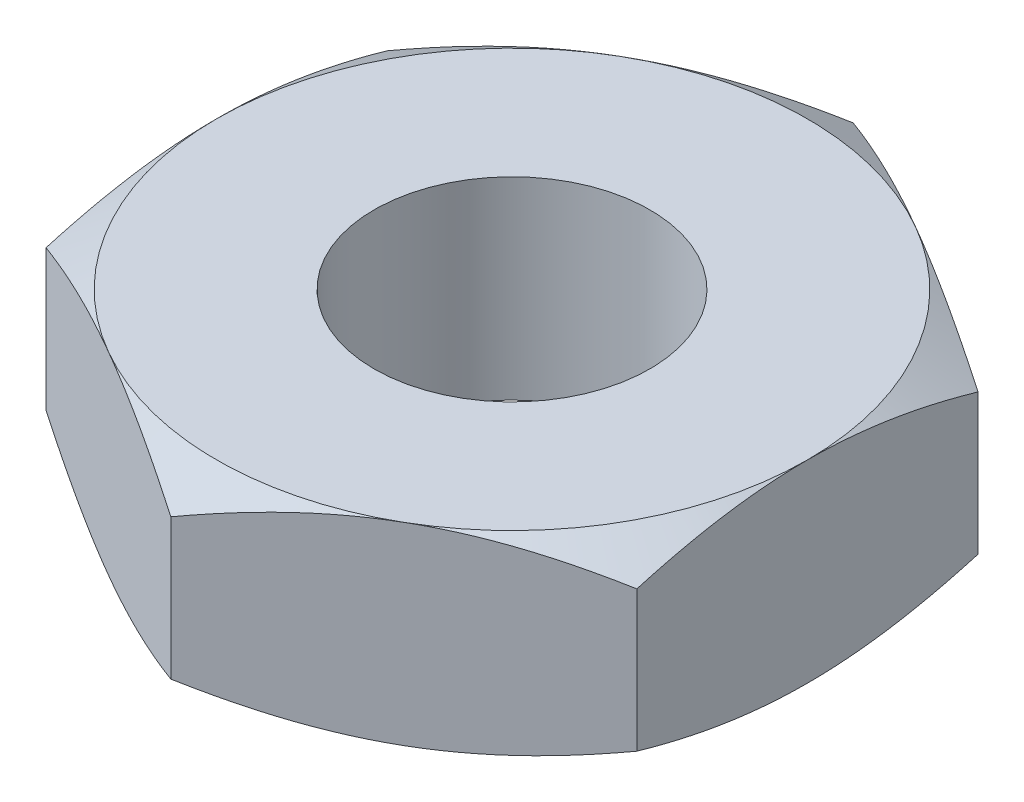
ISO-10303-21;
HEADER;
FILE_DESCRIPTION(('STEP AP214'),'2;1');
FILE_NAME('part.step','',(''),(''),'','','');
FILE_SCHEMA(('AUTOMOTIVE_DESIGN { 1 0 10303 214 1 1 1 1 }'));
ENDSEC;
DATA;
#1=APPLICATION_CONTEXT('core data for automotive mechanical design processes');
#2=APPLICATION_PROTOCOL_DEFINITION('international standard','automotive_design',2000,#1);
#3=PRODUCT_CONTEXT('',#1,'mechanical');
#4=PRODUCT('Part','Part','',(#3));
#5=PRODUCT_RELATED_PRODUCT_CATEGORY('part','',(#4));
#6=PRODUCT_DEFINITION_FORMATION('','',#4);
#7=PRODUCT_DEFINITION_CONTEXT('part definition',#1,'design');
#8=PRODUCT_DEFINITION('design','',#6,#7);
#9=PRODUCT_DEFINITION_SHAPE('','',#8);
#10=(LENGTH_UNIT() NAMED_UNIT(*) SI_UNIT(.MILLI.,.METRE.));
#11=(NAMED_UNIT(*) PLANE_ANGLE_UNIT() SI_UNIT($,.RADIAN.));
#12=(NAMED_UNIT(*) SI_UNIT($,.STERADIAN.) SOLID_ANGLE_UNIT());
#13=UNCERTAINTY_MEASURE_WITH_UNIT(LENGTH_MEASURE(1.E-05),#10,'distance_accuracy_value','');
#14=(GEOMETRIC_REPRESENTATION_CONTEXT(3) GLOBAL_UNCERTAINTY_ASSIGNED_CONTEXT((#13)) GLOBAL_UNIT_ASSIGNED_CONTEXT((#10,
#11,#12)) REPRESENTATION_CONTEXT('',''));
#15=CARTESIAN_POINT('',(0.,0.,0.));
#16=DIRECTION('',(0.,0.,1.));
#17=DIRECTION('',(1.,0.,0.));
#18=AXIS2_PLACEMENT_3D('',#15,#16,#17);
#19=CARTESIAN_POINT('',(2.75,1.8,-1.58771324027147));
#20=DIRECTION('',(-0.5,0.,0.866025403784439));
#21=DIRECTION('',(0.866025403784439,0.,0.5));
#22=AXIS2_PLACEMENT_3D('',#19,#20,#21);
#23=PLANE('',#22);
#24=DIRECTION('',(0.,-1.,0.));
#25=VECTOR('',#24,1.);
#26=CARTESIAN_POINT('',(2.75,1.8,-1.58771324027147));
#27=LINE('',#26,#25);
#28=CARTESIAN_POINT('',(2.75,1.55437990693814,-1.58771324027147));
#29=VERTEX_POINT('',#28);
#30=CARTESIAN_POINT('',(2.75,0.245620093061858,-1.58771324027147));
#31=VERTEX_POINT('',#30);
#32=EDGE_CURVE('E160',#29,#31,#27,.T.);
#33=ORIENTED_EDGE('',*,*,#32,.T.);
#34=CARTESIAN_POINT('',(2.7502,0.245686763364757,-1.58759777021763));
#35=CARTESIAN_POINT('',(2.62935077934009,0.20538766224926,-1.65737010029698));
#36=CARTESIAN_POINT('',(2.50745839737737,0.168736902597659,-1.72774469983533));
#37=CARTESIAN_POINT('',(2.26156287327211,0.104762182969799,-1.86971254687002));
#38=CARTESIAN_POINT('',(2.13755536142615,0.0774608556744955,-1.94130831721583));
#39=CARTESIAN_POINT('',(1.89107720202406,0.0349617452941153,-2.08361254889599));
#40=CARTESIAN_POINT('',(1.76864448141258,0.0194811186224564,-2.15429911309864));
#41=CARTESIAN_POINT('',(1.52320285763109,0.00099939736993891,-2.29600490065922));
#42=CARTESIAN_POINT('',(1.40019484676709,-0.00201700053740207,-2.36702360884403));
#43=CARTESIAN_POINT('',(1.17034121338921,0.00425314542854469,-2.49972966594897));
#44=CARTESIAN_POINT('',(1.06346120874598,0.0120001542767004,-2.56143686540072));
#45=CARTESIAN_POINT('',(0.850397532665252,0.0365551810643526,-2.68444923614046));
#46=CARTESIAN_POINT('',(0.744214598351112,0.053371589650568,-2.74575398185008));
#47=CARTESIAN_POINT('',(0.530711510606817,0.0954119223459535,-2.86902004703206));
#48=CARTESIAN_POINT('',(0.423418383857145,0.120814080687228,-2.93096576264318));
#49=CARTESIAN_POINT('',(0.210432520715949,0.178467225839978,-3.05393320806133));
#50=CARTESIAN_POINT('',(0.104737054973347,0.210704663298978,-3.11495651365995));
#51=CARTESIAN_POINT('',(-0.000200000000000443,0.245686763364756,-3.17554195059678));
#52=B_SPLINE_CURVE_WITH_KNOTS('',3,(#34,#35,#36,#37,#38,#39,#40,#41,#42,#43,#44,#45,#46,#47,#48,
#49,#50,#51),.UNSPECIFIED.,.F.,.F.,(4,2,2,2,2,2,2,2,4),(0.,0.435912828725887,0.87287355711633,
1.29901931904671,1.72464171213573,2.09526089052937,2.46622354066374,2.84541551798557,
3.22386274754524),.UNSPECIFIED.);
#53=CARTESIAN_POINT('',(1.375,0.,-2.38156986040721));
#54=VERTEX_POINT('',#53);
#55=EDGE_CURVE('E63',#31,#54,#52,.T.);
#56=ORIENTED_EDGE('',*,*,#55,.T.);
#57=CARTESIAN_POINT('',(0.,0.245620093061858,-3.17542648054294));
#58=VERTEX_POINT('',#57);
#59=EDGE_CURVE('E130',#54,#58,#52,.T.);
#60=ORIENTED_EDGE('',*,*,#59,.T.);
#61=DIRECTION('',(0.,-1.,0.));
#62=VECTOR('',#61,1.);
#63=CARTESIAN_POINT('',(0.,1.8,-3.17542648054294));
#64=LINE('',#63,#62);
#65=CARTESIAN_POINT('',(0.,1.55437990693814,-3.17542648054294));
#66=VERTEX_POINT('',#65);
#67=EDGE_CURVE('E276',#66,#58,#64,.T.);
#68=ORIENTED_EDGE('',*,*,#67,.F.);
#69=CARTESIAN_POINT('',(-0.000200000000000084,1.55431323663524,-3.17554195059678));
#70=CARTESIAN_POINT('',(0.120649220659906,1.59461233775074,-3.10576962051742));
#71=CARTESIAN_POINT('',(0.242541602622633,1.63126309740234,-3.03539502097908));
#72=CARTESIAN_POINT('',(0.488437126727892,1.6952378170302,-2.89342717394438));
#73=CARTESIAN_POINT('',(0.612444638573855,1.72253914432551,-2.82183140359858));
#74=CARTESIAN_POINT('',(0.858922797975943,1.76503825470589,-2.67952717191842));
#75=CARTESIAN_POINT('',(0.981355518587416,1.78051888137754,-2.60884060771577));
#76=CARTESIAN_POINT('',(1.22679714236891,1.79900060263006,-2.46713482015518));
#77=CARTESIAN_POINT('',(1.34980515323291,1.8020170005374,-2.39611611197037));
#78=CARTESIAN_POINT('',(1.57965878661079,1.79574685457146,-2.26341005486544));
#79=CARTESIAN_POINT('',(1.68653879125402,1.7879998457233,-2.20170285541368));
#80=CARTESIAN_POINT('',(1.89960246733475,1.76344481893565,-2.07869048467394));
#81=CARTESIAN_POINT('',(2.00578540164889,1.74662841034943,-2.01738573896433));
#82=CARTESIAN_POINT('',(2.21928848939318,1.70458807765405,-1.89411967378235));
#83=CARTESIAN_POINT('',(2.32658161614285,1.67918591931277,-1.83217395817123));
#84=CARTESIAN_POINT('',(2.53956747928405,1.62153277416002,-1.70920651275307));
#85=CARTESIAN_POINT('',(2.64526294502665,1.58929533670102,-1.64818320715446));
#86=CARTESIAN_POINT('',(2.7502,1.55431323663524,-1.58759777021763));
#87=B_SPLINE_CURVE_WITH_KNOTS('',3,(#69,#70,#71,#72,#73,#74,#75,#76,#77,#78,#79,#80,#81,#82,#83,
#84,#85,#86),.UNSPECIFIED.,.F.,.F.,(4,2,2,2,2,2,2,2,4),(0.,0.435912828725887,0.872873557116331,
1.29901931904671,1.72464171213573,2.09526089052937,2.46622354066374,2.84541551798557,
3.22386274754524),.UNSPECIFIED.);
#88=CARTESIAN_POINT('',(1.375,1.8,-2.38156986040721));
#89=VERTEX_POINT('',#88);
#90=EDGE_CURVE('E308',#66,#89,#87,.T.);
#91=ORIENTED_EDGE('',*,*,#90,.T.);
#92=EDGE_CURVE('E317',#89,#29,#87,.T.);
#93=ORIENTED_EDGE('',*,*,#92,.T.);
#94=EDGE_LOOP('',(#33,#56,#60,#68,#91,#93));
#95=FACE_BOUND('',#94,.T.);
#96=ADVANCED_FACE('F40',(#95),#23,.F.);
#97=CARTESIAN_POINT('',(0.,1.8,-3.17542648054294));
#98=DIRECTION('',(0.5,0.,0.866025403784439));
#99=DIRECTION('',(0.866025403784439,0.,-0.5));
#100=AXIS2_PLACEMENT_3D('',#97,#98,#99);
#101=PLANE('',#100);
#102=ORIENTED_EDGE('',*,*,#67,.T.);
#103=CARTESIAN_POINT('',(0.000199999999999961,0.245686763364756,-3.17554195059678));
#104=CARTESIAN_POINT('',(-0.120649220659906,0.205387662249259,-3.10576962051742));
#105=CARTESIAN_POINT('',(-0.242541602622633,0.168736902597659,-3.03539502097908));
#106=CARTESIAN_POINT('',(-0.488437126727892,0.104762182969798,-2.89342717394438));
#107=CARTESIAN_POINT('',(-0.612444638573855,0.0774608556744951,-2.82183140359858));
#108=CARTESIAN_POINT('',(-0.858922797975942,0.034961745294115,-2.67952717191842));
#109=CARTESIAN_POINT('',(-0.981355518587416,0.019481118622456,-2.60884060771577));
#110=CARTESIAN_POINT('',(-1.22679714236891,0.000999397369938881,-2.46713482015518));
#111=CARTESIAN_POINT('',(-1.34980515323291,-0.00201700053740175,-2.39611611197037));
#112=CARTESIAN_POINT('',(-1.57965878661079,0.00425314542854518,-2.26341005486544));
#113=CARTESIAN_POINT('',(-1.68653879125402,0.0120001542767007,-2.20170285541369));
#114=CARTESIAN_POINT('',(-1.89960246733475,0.0365551810643529,-2.07869048467395));
#115=CARTESIAN_POINT('',(-2.00578540164889,0.0533715896505683,-2.01738573896433));
#116=CARTESIAN_POINT('',(-2.21928848939318,0.0954119223459539,-1.89411967378235));
#117=CARTESIAN_POINT('',(-2.32658161614285,0.120814080687228,-1.83217395817123));
#118=CARTESIAN_POINT('',(-2.53956747928405,0.178467225839979,-1.70920651275307));
#119=CARTESIAN_POINT('',(-2.64526294502665,0.210704663298979,-1.64818320715446));
#120=CARTESIAN_POINT('',(-2.7502,0.245686763364757,-1.58759777021763));
#121=B_SPLINE_CURVE_WITH_KNOTS('',3,(#103,#104,#105,#106,#107,#108,#109,#110,#111,#112,#113,
#114,#115,#116,#117,#118,#119,#120),.UNSPECIFIED.,.F.,.F.,(4,2,2,2,2,2,2,2,4),(0.,
0.435912828725887,0.87287355711633,1.29901931904671,1.72464171213573,2.09526089052937,
2.46622354066374,2.84541551798557,3.22386274754524),.UNSPECIFIED.);
#122=CARTESIAN_POINT('',(-1.375,0.,-2.38156986040721));
#123=VERTEX_POINT('',#122);
#124=EDGE_CURVE('E136',#58,#123,#121,.T.);
#125=ORIENTED_EDGE('',*,*,#124,.T.);
#126=CARTESIAN_POINT('',(-2.75,0.245620093061858,-1.58771324027147));
#127=VERTEX_POINT('',#126);
#128=EDGE_CURVE('E174',#123,#127,#121,.T.);
#129=ORIENTED_EDGE('',*,*,#128,.T.);
#130=DIRECTION('',(0.,-1.,0.));
#131=VECTOR('',#130,1.);
#132=CARTESIAN_POINT('',(-2.75,1.8,-1.58771324027147));
#133=LINE('',#132,#131);
#134=CARTESIAN_POINT('',(-2.75,1.55437990693814,-1.58771324027147));
#135=VERTEX_POINT('',#134);
#136=EDGE_CURVE('E272',#135,#127,#133,.T.);
#137=ORIENTED_EDGE('',*,*,#136,.F.);
#138=CARTESIAN_POINT('',(-2.7502,1.55431323663524,-1.58759777021763));
#139=CARTESIAN_POINT('',(-2.62935077934009,1.59461233775074,-1.65737010029698));
#140=CARTESIAN_POINT('',(-2.50745839737737,1.63126309740234,-1.72774469983533));
#141=CARTESIAN_POINT('',(-2.26156287327211,1.6952378170302,-1.86971254687002));
#142=CARTESIAN_POINT('',(-2.13755536142615,1.7225391443255,-1.94130831721583));
#143=CARTESIAN_POINT('',(-1.89107720202406,1.76503825470588,-2.08361254889599));
#144=CARTESIAN_POINT('',(-1.76864448141258,1.78051888137754,-2.15429911309864));
#145=CARTESIAN_POINT('',(-1.52320285763109,1.79900060263006,-2.29600490065922));
#146=CARTESIAN_POINT('',(-1.40019484676709,1.8020170005374,-2.36702360884403));
#147=CARTESIAN_POINT('',(-1.17034121338921,1.79574685457145,-2.49972966594897));
#148=CARTESIAN_POINT('',(-1.06346120874598,1.7879998457233,-2.56143686540072));
#149=CARTESIAN_POINT('',(-0.850397532665252,1.76344481893565,-2.68444923614046));
#150=CARTESIAN_POINT('',(-0.744214598351112,1.74662841034943,-2.74575398185008));
#151=CARTESIAN_POINT('',(-0.530711510606817,1.70458807765405,-2.86902004703206));
#152=CARTESIAN_POINT('',(-0.423418383857146,1.67918591931277,-2.93096576264318));
#153=CARTESIAN_POINT('',(-0.210432520715949,1.62153277416002,-3.05393320806133));
#154=CARTESIAN_POINT('',(-0.104737054973348,1.58929533670102,-3.11495651365995));
#155=CARTESIAN_POINT('',(0.000199999999999814,1.55431323663524,-3.17554195059678));
#156=B_SPLINE_CURVE_WITH_KNOTS('',3,(#138,#139,#140,#141,#142,#143,#144,#145,#146,#147,#148,
#149,#150,#151,#152,#153,#154,#155),.UNSPECIFIED.,.F.,.F.,(4,2,2,2,2,2,2,2,4),(0.,
0.435912828725887,0.87287355711633,1.29901931904671,1.72464171213573,2.09526089052937,
2.46622354066374,2.84541551798557,3.22386274754524),.UNSPECIFIED.);
#157=CARTESIAN_POINT('',(-1.375,1.8,-2.38156986040721));
#158=VERTEX_POINT('',#157);
#159=EDGE_CURVE('E348',#135,#158,#156,.T.);
#160=ORIENTED_EDGE('',*,*,#159,.T.);
#161=EDGE_CURVE('E244',#158,#66,#156,.T.);
#162=ORIENTED_EDGE('',*,*,#161,.T.);
#163=EDGE_LOOP('',(#102,#125,#129,#137,#160,#162));
#164=FACE_BOUND('',#163,.T.);
#165=ADVANCED_FACE('F227',(#164),#101,.F.);
#166=CARTESIAN_POINT('',(-2.75,1.8,-1.58771324027147));
#167=DIRECTION('',(1.,0.,0.));
#168=DIRECTION('',(0.,0.,-1.));
#169=AXIS2_PLACEMENT_3D('',#166,#167,#168);
#170=PLANE('',#169);
#171=ORIENTED_EDGE('',*,*,#136,.T.);
#172=CARTESIAN_POINT('',(-2.75,1.31594843960292,-4.21084949309675));
#173=CARTESIAN_POINT('',(-2.75,1.25759993615222,-4.09010894214089));
#174=CARTESIAN_POINT('',(-2.75,1.19983146511756,-3.96908292065508));
#175=CARTESIAN_POINT('',(-2.75,1.08578603842303,-3.72630558284843));
#176=CARTESIAN_POINT('',(-2.75,1.02950934100245,-3.604554145362));
#177=CARTESIAN_POINT('',(-2.75,0.918482443352741,-3.35951393034354));
#178=CARTESIAN_POINT('',(-2.75,0.863742821605822,-3.23622034236436));
#179=CARTESIAN_POINT('',(-2.75,0.75661477747644,-2.98861980138743));
#180=CARTESIAN_POINT('',(-2.75,0.70422623253675,-2.86431290161181));
#181=CARTESIAN_POINT('',(-2.75,0.601803572146112,-2.61294485887171));
#182=CARTESIAN_POINT('',(-2.75,0.551806257898382,-2.48586863815654));
#183=CARTESIAN_POINT('',(-2.75,0.455727408784592,-2.2302173217154));
#184=CARTESIAN_POINT('',(-2.75,0.409646309576963,-2.10164206103363));
#185=CARTESIAN_POINT('',(-2.75,0.322638077046224,-1.84305218799467));
#186=CARTESIAN_POINT('',(-2.75,0.281699986413882,-1.71304130052583));
#187=CARTESIAN_POINT('',(-2.75,0.206307307624344,-1.45117125062147));
#188=CARTESIAN_POINT('',(-2.75,0.171850669152763,-1.31931268690202));
#189=CARTESIAN_POINT('',(-2.75,0.111093671530901,-1.05365722480012));
#190=CARTESIAN_POINT('',(-2.75,0.0847954840951194,-0.919859820217587));
#191=CARTESIAN_POINT('',(-2.75,0.04212603719661,-0.650651874037378));
#192=CARTESIAN_POINT('',(-2.75,0.0257547865105423,-0.515241331013592));
#193=CARTESIAN_POINT('',(-2.75,0.00438749654023722,-0.244373242869208));
#194=CARTESIAN_POINT('',(-2.75,-0.000680556773216046,-0.108921526377131));
#195=CARTESIAN_POINT('',(-2.75,0.000827795632672014,0.161887058855136));
#196=CARTESIAN_POINT('',(-2.75,0.00740117868555372,0.297243943089642));
#197=CARTESIAN_POINT('',(-2.75,0.0281041300468438,0.528385436717545));
#198=CARTESIAN_POINT('',(-2.75,0.0395376410301884,0.624425050137505));
#199=CARTESIAN_POINT('',(-2.75,0.0675217196133515,0.815762399811552));
#200=CARTESIAN_POINT('',(-2.75,0.084073094227683,0.911060016631976));
#201=CARTESIAN_POINT('',(-2.75,0.140535361278286,1.19576218748918));
#202=CARTESIAN_POINT('',(-2.75,0.187239859417296,1.38383224738499));
#203=CARTESIAN_POINT('',(-2.75,0.267792497030582,1.66525048947488));
#204=CARTESIAN_POINT('',(-2.75,0.296803334995505,1.76006556248561));
#205=CARTESIAN_POINT('',(-2.75,0.357695648906593,1.94870609382218));
#206=CARTESIAN_POINT('',(-2.75,0.389575144878509,2.04253218553699));
#207=CARTESIAN_POINT('',(-2.75,0.455541418186454,2.22880240354988));
#208=CARTESIAN_POINT('',(-2.75,0.489614761455539,2.32125133588455));
#209=CARTESIAN_POINT('',(-2.75,0.559761368231117,2.50543192042633));
#210=CARTESIAN_POINT('',(-2.75,0.595835440037326,2.59716326539583));
#211=CARTESIAN_POINT('',(-2.75,0.632712441997492,2.6885629305335));
#212=B_SPLINE_CURVE_WITH_KNOTS('',3,(#172,#173,#174,#175,#176,#177,#178,#179,#180,#181,#182,
#183,#184,#185,#186,#187,#188,#189,#190,#191,#192,#193,#194,#195,#196,#197,#198,#199,#200,#201,
#202,#203,#204,#205,#206,#207,#208,#209,#210,#211),.UNSPECIFIED.,.F.,.F.,(4,2,2,2,2,2,2,2,2,2,2,
2,2,2,2,2,2,2,2,4),(0.,0.402305607365935,0.804680408536995,1.20935783819118,1.61401414820818,
2.02363838185769,2.43330812457348,2.842089694796,3.25074173456635,3.65950246109142,
4.06826354901183,4.47441284024649,4.88045669141171,5.17046846817545,5.46052599902452,
6.04107275309884,6.33851131304663,6.63574613017457,6.93130791005795,7.22698998004826),.UNSPECIFIED.);
#213=CARTESIAN_POINT('',(-2.75,0.,0.));
#214=VERTEX_POINT('',#213);
#215=EDGE_CURVE('E221',#127,#214,#212,.T.);
#216=ORIENTED_EDGE('',*,*,#215,.T.);
#217=CARTESIAN_POINT('',(-2.74999999999999,0.245620093061858,1.58771324027148));
#218=VERTEX_POINT('',#217);
#219=EDGE_CURVE('E213',#214,#218,#212,.T.);
#220=ORIENTED_EDGE('',*,*,#219,.T.);
#221=DIRECTION('',(0.,-1.,0.));
#222=VECTOR('',#221,1.);
#223=CARTESIAN_POINT('',(-2.75,1.8,1.58771324027147));
#224=LINE('',#223,#222);
#225=CARTESIAN_POINT('',(-2.75,1.55437990693814,1.58771324027148));
#226=VERTEX_POINT('',#225);
#227=EDGE_CURVE('E268',#226,#218,#224,.T.);
#228=ORIENTED_EDGE('',*,*,#227,.F.);
#229=CARTESIAN_POINT('',(-2.75,0.484051560397082,-4.21084949309675));
#230=CARTESIAN_POINT('',(-2.75,0.542400063847779,-4.09010894214089));
#231=CARTESIAN_POINT('',(-2.75,0.600168534882435,-3.96908292065509));
#232=CARTESIAN_POINT('',(-2.75,0.714213961576969,-3.72630558284843));
#233=CARTESIAN_POINT('',(-2.75,0.770490658997547,-3.604554145362));
#234=CARTESIAN_POINT('',(-2.75,0.881517556647259,-3.35951393034354));
#235=CARTESIAN_POINT('',(-2.75,0.936257178394178,-3.23622034236436));
#236=CARTESIAN_POINT('',(-2.75,1.04338522252356,-2.98861980138743));
#237=CARTESIAN_POINT('',(-2.75,1.09577376746325,-2.86431290161181));
#238=CARTESIAN_POINT('',(-2.75,1.19819642785389,-2.61294485887171));
#239=CARTESIAN_POINT('',(-2.75,1.24819374210162,-2.48586863815653));
#240=CARTESIAN_POINT('',(-2.75,1.34427259121541,-2.2302173217154));
#241=CARTESIAN_POINT('',(-2.75,1.39035369042304,-2.10164206103363));
#242=CARTESIAN_POINT('',(-2.75,1.47736192295378,-1.84305218799467));
#243=CARTESIAN_POINT('',(-2.75,1.51830001358612,-1.71304130052583));
#244=CARTESIAN_POINT('',(-2.75,1.59369269237566,-1.45117125062147));
#245=CARTESIAN_POINT('',(-2.75,1.62814933084724,-1.31931268690202));
#246=CARTESIAN_POINT('',(-2.75,1.6889063284691,-1.05365722480012));
#247=CARTESIAN_POINT('',(-2.75,1.71520451590488,-0.919859820217587));
#248=CARTESIAN_POINT('',(-2.75,1.75787396280339,-0.650651874037377));
#249=CARTESIAN_POINT('',(-2.75,1.77424521348946,-0.515241331013591));
#250=CARTESIAN_POINT('',(-2.75,1.79561250345976,-0.244373242869208));
#251=CARTESIAN_POINT('',(-2.75,1.80068055677322,-0.108921526377131));
#252=CARTESIAN_POINT('',(-2.75,1.79917220436733,0.161887058855136));
#253=CARTESIAN_POINT('',(-2.75,1.79259882131445,0.297243943089642));
#254=CARTESIAN_POINT('',(-2.75,1.77189586995316,0.528385436717545));
#255=CARTESIAN_POINT('',(-2.75,1.76046235896981,0.624425050137505));
#256=CARTESIAN_POINT('',(-2.75,1.73247828038665,0.815762399811552));
#257=CARTESIAN_POINT('',(-2.75,1.71592690577232,0.911060016631976));
#258=CARTESIAN_POINT('',(-2.75,1.65946463872172,1.19576218748918));
#259=CARTESIAN_POINT('',(-2.75,1.61276014058271,1.38383224738498));
#260=CARTESIAN_POINT('',(-2.75,1.53220750296942,1.66525048947488));
#261=CARTESIAN_POINT('',(-2.75,1.5031966650045,1.7600655624856));
#262=CARTESIAN_POINT('',(-2.75,1.44230435109341,1.94870609382218));
#263=CARTESIAN_POINT('',(-2.75,1.41042485512149,2.04253218553699));
#264=CARTESIAN_POINT('',(-2.75,1.34445858181355,2.22880240354988));
#265=CARTESIAN_POINT('',(-2.75,1.31038523854446,2.32125133588455));
#266=CARTESIAN_POINT('',(-2.75,1.24023863176889,2.50543192042633));
#267=CARTESIAN_POINT('',(-2.75,1.20416455996268,2.59716326539583));
#268=CARTESIAN_POINT('',(-2.75,1.16728755800251,2.6885629305335));
#269=B_SPLINE_CURVE_WITH_KNOTS('',3,(#229,#230,#231,#232,#233,#234,#235,#236,#237,#238,#239,
#240,#241,#242,#243,#244,#245,#246,#247,#248,#249,#250,#251,#252,#253,#254,#255,#256,#257,#258,
#259,#260,#261,#262,#263,#264,#265,#266,#267,#268),.UNSPECIFIED.,.F.,.F.,(4,2,2,2,2,2,2,2,2,2,2,
2,2,2,2,2,2,2,2,4),(0.,0.402305607365936,0.804680408536996,1.20935783819118,1.61401414820818,
2.0236383818577,2.43330812457348,2.842089694796,3.25074173456636,3.65950246109143,
4.06826354901183,4.47441284024649,4.88045669141171,5.17046846817545,5.46052599902452,
6.04107275309884,6.33851131304663,6.63574613017457,6.93130791005795,7.22698998004826),.UNSPECIFIED.);
#270=CARTESIAN_POINT('',(-2.75,1.8,0.));
#271=VERTEX_POINT('',#270);
#272=EDGE_CURVE('E242',#226,#271,#269,.F.);
#273=ORIENTED_EDGE('',*,*,#272,.T.);
#274=EDGE_CURVE('E233',#271,#135,#269,.F.);
#275=ORIENTED_EDGE('',*,*,#274,.T.);
#276=EDGE_LOOP('',(#171,#216,#220,#228,#273,#275));
#277=FACE_BOUND('',#276,.T.);
#278=ADVANCED_FACE('F223',(#277),#170,.F.);
#279=CARTESIAN_POINT('',(-2.75,1.8,1.58771324027147));
#280=DIRECTION('',(0.5,0.,-0.866025403784439));
#281=DIRECTION('',(-0.866025403784439,0.,-0.5));
#282=AXIS2_PLACEMENT_3D('',#279,#280,#281);
#283=PLANE('',#282);
#284=ORIENTED_EDGE('',*,*,#227,.T.);
#285=CARTESIAN_POINT('',(-2.7502,0.245686763364758,1.58759777021764));
#286=CARTESIAN_POINT('',(-2.62935077934009,0.205387662249261,1.65737010029699));
#287=CARTESIAN_POINT('',(-2.50745839737737,0.168736902597661,1.72774469983533));
#288=CARTESIAN_POINT('',(-2.26156287327211,0.1047621829698,1.86971254687003));
#289=CARTESIAN_POINT('',(-2.13755536142614,0.0774608556744973,1.94130831721583));
#290=CARTESIAN_POINT('',(-1.89107720202406,0.0349617452941174,2.08361254889599));
#291=CARTESIAN_POINT('',(-1.76864448141258,0.0194811186224584,2.15429911309864));
#292=CARTESIAN_POINT('',(-1.52320285763109,0.000999397369941331,2.29600490065923));
#293=CARTESIAN_POINT('',(-1.40019484676709,-0.00201700053739932,2.36702360884404));
#294=CARTESIAN_POINT('',(-1.17034121338921,0.00425314542854779,2.49972966594897));
#295=CARTESIAN_POINT('',(-1.06346120874598,0.0120001542767035,2.56143686540073));
#296=CARTESIAN_POINT('',(-0.850397532665251,0.0365551810643558,2.68444923614047));
#297=CARTESIAN_POINT('',(-0.744214598351111,0.0533715896505712,2.74575398185008));
#298=CARTESIAN_POINT('',(-0.530711510606816,0.0954119223459568,2.86902004703207));
#299=CARTESIAN_POINT('',(-0.423418383857145,0.120814080687231,2.93096576264319));
#300=CARTESIAN_POINT('',(-0.210432520715949,0.178467225839982,3.05393320806134));
#301=CARTESIAN_POINT('',(-0.104737054973347,0.210704663298982,3.11495651365995));
#302=CARTESIAN_POINT('',(0.000200000000000377,0.245686763364759,3.17554195059678));
#303=B_SPLINE_CURVE_WITH_KNOTS('',3,(#285,#286,#287,#288,#289,#290,#291,#292,#293,#294,#295,
#296,#297,#298,#299,#300,#301,#302),.UNSPECIFIED.,.F.,.F.,(4,2,2,2,2,2,2,2,4),(0.,
0.435912828725888,0.872873557116331,1.29901931904671,1.72464171213573,2.09526089052937,
2.46622354066374,2.84541551798557,3.22386274754524),.UNSPECIFIED.);
#304=CARTESIAN_POINT('',(-1.375,0.,2.38156986040721));
#305=VERTEX_POINT('',#304);
#306=EDGE_CURVE('E222',#218,#305,#303,.T.);
#307=ORIENTED_EDGE('',*,*,#306,.T.);
#308=CARTESIAN_POINT('',(0.,0.245620093061858,3.17542648054294));
#309=VERTEX_POINT('',#308);
#310=EDGE_CURVE('E207',#305,#309,#303,.T.);
#311=ORIENTED_EDGE('',*,*,#310,.T.);
#312=DIRECTION('',(0.,-1.,0.));
#313=VECTOR('',#312,1.);
#314=CARTESIAN_POINT('',(0.,1.8,3.17542648054294));
#315=LINE('',#314,#313);
#316=CARTESIAN_POINT('',(0.,1.55437990693814,3.17542648054294));
#317=VERTEX_POINT('',#316);
#318=EDGE_CURVE('E264',#317,#309,#315,.T.);
#319=ORIENTED_EDGE('',*,*,#318,.F.);
#320=CARTESIAN_POINT('',(0.000200000000000199,1.55431323663524,3.17554195059678));
#321=CARTESIAN_POINT('',(-0.120649220659905,1.59461233775074,3.10576962051743));
#322=CARTESIAN_POINT('',(-0.242541602622633,1.63126309740234,3.03539502097908));
#323=CARTESIAN_POINT('',(-0.488437126727892,1.6952378170302,2.89342717394439));
#324=CARTESIAN_POINT('',(-0.612444638573855,1.7225391443255,2.82183140359859));
#325=CARTESIAN_POINT('',(-0.858922797975943,1.76503825470588,2.67952717191843));
#326=CARTESIAN_POINT('',(-0.981355518587416,1.78051888137754,2.60884060771578));
#327=CARTESIAN_POINT('',(-1.22679714236891,1.79900060263006,2.46713482015519));
#328=CARTESIAN_POINT('',(-1.34980515323291,1.8020170005374,2.39611611197038));
#329=CARTESIAN_POINT('',(-1.57965878661079,1.79574685457145,2.26341005486545));
#330=CARTESIAN_POINT('',(-1.68653879125402,1.7879998457233,2.20170285541369));
#331=CARTESIAN_POINT('',(-1.89960246733475,1.76344481893565,2.07869048467395));
#332=CARTESIAN_POINT('',(-2.00578540164889,1.74662841034943,2.01738573896434));
#333=CARTESIAN_POINT('',(-2.21928848939318,1.70458807765405,1.89411967378235));
#334=CARTESIAN_POINT('',(-2.32658161614285,1.67918591931277,1.83217395817123));
#335=CARTESIAN_POINT('',(-2.53956747928405,1.62153277416002,1.70920651275308));
#336=CARTESIAN_POINT('',(-2.64526294502665,1.58929533670102,1.64818320715446));
#337=CARTESIAN_POINT('',(-2.7502,1.55431323663524,1.58759777021764));
#338=B_SPLINE_CURVE_WITH_KNOTS('',3,(#320,#321,#322,#323,#324,#325,#326,#327,#328,#329,#330,
#331,#332,#333,#334,#335,#336,#337),.UNSPECIFIED.,.F.,.F.,(4,2,2,2,2,2,2,2,4),(0.,
0.435912828725888,0.872873557116331,1.29901931904671,1.72464171213573,2.09526089052937,
2.46622354066374,2.84541551798557,3.22386274754524),.UNSPECIFIED.);
#339=CARTESIAN_POINT('',(-1.375,1.8,2.38156986040721));
#340=VERTEX_POINT('',#339);
#341=EDGE_CURVE('E325',#317,#340,#338,.T.);
#342=ORIENTED_EDGE('',*,*,#341,.T.);
#343=EDGE_CURVE('E243',#340,#226,#338,.T.);
#344=ORIENTED_EDGE('',*,*,#343,.T.);
#345=EDGE_LOOP('',(#284,#307,#311,#319,#342,#344));
#346=FACE_BOUND('',#345,.T.);
#347=ADVANCED_FACE('F226',(#346),#283,.F.);
#348=CARTESIAN_POINT('',(0.,1.8,3.17542648054294));
#349=DIRECTION('',(-0.5,0.,-0.866025403784439));
#350=DIRECTION('',(-0.866025403784439,0.,0.5));
#351=AXIS2_PLACEMENT_3D('',#348,#349,#350);
#352=PLANE('',#351);
#353=ORIENTED_EDGE('',*,*,#318,.T.);
#354=CARTESIAN_POINT('',(-0.000199999999999858,0.245686763364759,3.17554195059678));
#355=CARTESIAN_POINT('',(0.120649220659906,0.205387662249262,3.10576962051743));
#356=CARTESIAN_POINT('',(0.242541602622634,0.168736902597662,3.03539502097908));
#357=CARTESIAN_POINT('',(0.488437126727893,0.104762182969801,2.89342717394439));
#358=CARTESIAN_POINT('',(0.612444638573856,0.0774608556744981,2.82183140359859));
#359=CARTESIAN_POINT('',(0.858922797975944,0.034961745294118,2.67952717191843));
#360=CARTESIAN_POINT('',(0.981355518587418,0.0194811186224592,2.60884060771578));
#361=CARTESIAN_POINT('',(1.22679714236892,0.00099939736994209,2.46713482015519));
#362=CARTESIAN_POINT('',(1.34980515323291,-0.00201700053739859,2.39611611197038));
#363=CARTESIAN_POINT('',(1.57965878661079,0.00425314542854836,2.26341005486545));
#364=CARTESIAN_POINT('',(1.68653879125402,0.0120001542767039,2.20170285541369));
#365=CARTESIAN_POINT('',(1.89960246733475,0.036555181064356,2.07869048467395));
#366=CARTESIAN_POINT('',(2.00578540164889,0.0533715896505713,2.01738573896434));
#367=CARTESIAN_POINT('',(2.21928848939318,0.0954119223459566,1.89411967378235));
#368=CARTESIAN_POINT('',(2.32658161614285,0.120814080687231,1.83217395817123));
#369=CARTESIAN_POINT('',(2.53956747928405,0.178467225839981,1.70920651275308));
#370=CARTESIAN_POINT('',(2.64526294502665,0.210704663298981,1.64818320715447));
#371=CARTESIAN_POINT('',(2.7502,0.245686763364758,1.58759777021764));
#372=B_SPLINE_CURVE_WITH_KNOTS('',3,(#354,#355,#356,#357,#358,#359,#360,#361,#362,#363,#364,
#365,#366,#367,#368,#369,#370,#371),.UNSPECIFIED.,.F.,.F.,(4,2,2,2,2,2,2,2,4),(0.,
0.435912828725888,0.872873557116332,1.29901931904671,1.72464171213574,2.09526089052937,
2.46622354066374,2.84541551798557,3.22386274754524),.UNSPECIFIED.);
#373=CARTESIAN_POINT('',(1.375,0.,2.38156986040721));
#374=VERTEX_POINT('',#373);
#375=EDGE_CURVE('E365',#309,#374,#372,.T.);
#376=ORIENTED_EDGE('',*,*,#375,.T.);
#377=CARTESIAN_POINT('',(2.75,0.245620093061858,1.58771324027147));
#378=VERTEX_POINT('',#377);
#379=EDGE_CURVE('E199',#374,#378,#372,.T.);
#380=ORIENTED_EDGE('',*,*,#379,.T.);
#381=DIRECTION('',(0.,-1.,0.));
#382=VECTOR('',#381,1.);
#383=CARTESIAN_POINT('',(2.75,1.8,1.58771324027148));
#384=LINE('',#383,#382);
#385=CARTESIAN_POINT('',(2.75,1.55437990693814,1.58771324027148));
#386=VERTEX_POINT('',#385);
#387=EDGE_CURVE('E260',#386,#378,#384,.T.);
#388=ORIENTED_EDGE('',*,*,#387,.F.);
#389=CARTESIAN_POINT('',(2.7502,1.55431323663524,1.58759777021764));
#390=CARTESIAN_POINT('',(2.62935077934009,1.59461233775074,1.65737010029699));
#391=CARTESIAN_POINT('',(2.50745839737737,1.63126309740234,1.72774469983534));
#392=CARTESIAN_POINT('',(2.26156287327211,1.6952378170302,1.86971254687003));
#393=CARTESIAN_POINT('',(2.13755536142614,1.7225391443255,1.94130831721583));
#394=CARTESIAN_POINT('',(1.89107720202406,1.76503825470588,2.08361254889599));
#395=CARTESIAN_POINT('',(1.76864448141258,1.78051888137754,2.15429911309865));
#396=CARTESIAN_POINT('',(1.52320285763108,1.79900060263006,2.29600490065923));
#397=CARTESIAN_POINT('',(1.40019484676709,1.8020170005374,2.36702360884404));
#398=CARTESIAN_POINT('',(1.17034121338921,1.79574685457145,2.49972966594897));
#399=CARTESIAN_POINT('',(1.06346120874598,1.7879998457233,2.56143686540073));
#400=CARTESIAN_POINT('',(0.850397532665251,1.76344481893565,2.68444923614047));
#401=CARTESIAN_POINT('',(0.744214598351111,1.74662841034943,2.74575398185008));
#402=CARTESIAN_POINT('',(0.530711510606816,1.70458807765405,2.86902004703207));
#403=CARTESIAN_POINT('',(0.423418383857145,1.67918591931277,2.93096576264319));
#404=CARTESIAN_POINT('',(0.210432520715949,1.62153277416002,3.05393320806134));
#405=CARTESIAN_POINT('',(0.104737054973348,1.58929533670102,3.11495651365995));
#406=CARTESIAN_POINT('',(-0.000199999999999715,1.55431323663524,3.17554195059678));
#407=B_SPLINE_CURVE_WITH_KNOTS('',3,(#389,#390,#391,#392,#393,#394,#395,#396,#397,#398,#399,
#400,#401,#402,#403,#404,#405,#406),.UNSPECIFIED.,.F.,.F.,(4,2,2,2,2,2,2,2,4),(0.,
0.435912828725888,0.872873557116331,1.29901931904671,1.72464171213573,2.09526089052937,
2.46622354066374,2.84541551798557,3.22386274754524),.UNSPECIFIED.);
#408=CARTESIAN_POINT('',(1.375,1.8,2.38156986040721));
#409=VERTEX_POINT('',#408);
#410=EDGE_CURVE('E327',#386,#409,#407,.T.);
#411=ORIENTED_EDGE('',*,*,#410,.T.);
#412=EDGE_CURVE('E319',#409,#317,#407,.T.);
#413=ORIENTED_EDGE('',*,*,#412,.T.);
#414=EDGE_LOOP('',(#353,#376,#380,#388,#411,#413));
#415=FACE_BOUND('',#414,.T.);
#416=ADVANCED_FACE('F379',(#415),#352,.F.);
#417=CARTESIAN_POINT('',(2.75,1.8,1.58771324027148));
#418=DIRECTION('',(-1.,0.,0.));
#419=DIRECTION('',(0.,0.,1.));
#420=AXIS2_PLACEMENT_3D('',#417,#418,#419);
#421=PLANE('',#420);
#422=ORIENTED_EDGE('',*,*,#387,.T.);
#423=CARTESIAN_POINT('',(2.75,1.31594891408977,-4.21085047466774));
#424=CARTESIAN_POINT('',(2.75,1.25760039033706,-4.09010989011094));
#425=CARTESIAN_POINT('',(2.75,1.19983189901234,-3.96908383499852));
#426=CARTESIAN_POINT('',(2.75,1.08578643184574,-3.72630642982621));
#427=CARTESIAN_POINT('',(2.75,1.02950971424318,-3.60455495860071));
#428=CARTESIAN_POINT('',(2.75,0.918482776219311,-3.35951467553997));
#429=CARTESIAN_POINT('',(2.75,0.863743134284529,-3.23622105325521));
#430=CARTESIAN_POINT('',(2.75,0.7566150501509,-2.98862044341193));
#431=CARTESIAN_POINT('',(2.75,0.704226485394789,-2.86431350907558));
#432=CARTESIAN_POINT('',(2.75,0.601803785712119,-2.61294539628322));
#433=CARTESIAN_POINT('',(2.75,0.551806451999386,-2.48586914007059));
#434=CARTESIAN_POINT('',(2.75,0.455727565035128,-2.23021775204036));
#435=CARTESIAN_POINT('',(2.75,0.409646447442418,-2.1016424552668));
#436=CARTESIAN_POINT('',(2.75,0.322638179971965,-1.84305250936245));
#437=CARTESIAN_POINT('',(2.75,0.281700072779022,-1.7130415851225));
#438=CARTESIAN_POINT('',(2.75,0.206307363670479,-1.45117146066373));
#439=CARTESIAN_POINT('',(2.75,0.171850711438671,-1.31931285916158));
#440=CARTESIAN_POINT('',(2.75,0.111093685978182,-1.05365730058872));
#441=CARTESIAN_POINT('',(2.75,0.084795485676615,-0.919859837035216));
#442=CARTESIAN_POINT('',(2.75,0.042126022040423,-0.6506517715884));
#443=CARTESIAN_POINT('',(2.75,0.0257547674760033,-0.515241168270025));
#444=CARTESIAN_POINT('',(2.75,0.00438748036256761,-0.244372959827886));
#445=CARTESIAN_POINT('',(2.75,-0.000680566304422186,-0.108921183336601));
#446=CARTESIAN_POINT('',(2.75,0.000827809639781124,0.161887520872989));
#447=CARTESIAN_POINT('',(2.75,0.00740120958679076,0.297244464085861));
#448=CARTESIAN_POINT('',(2.75,0.0281041947704403,0.528386033126795));
#449=CARTESIAN_POINT('',(2.75,0.0395377192911566,0.624425663637143));
#450=CARTESIAN_POINT('',(2.75,0.0675218256946278,0.815763046774004));
#451=CARTESIAN_POINT('',(2.75,0.0840732145920206,0.911060679966739));
#452=CARTESIAN_POINT('',(2.75,0.14053552483902,1.19576289915277));
#453=CARTESIAN_POINT('',(2.75,0.187240052210049,1.38383299011475));
#454=CARTESIAN_POINT('',(2.75,0.267792733064851,1.66525127863568));
#455=CARTESIAN_POINT('',(2.75,0.296803585547794,1.76006636738016));
#456=CARTESIAN_POINT('',(2.75,0.357695928076052,1.94870693000561));
#457=CARTESIAN_POINT('',(2.75,0.389575438146926,2.04253303727579));
#458=CARTESIAN_POINT('',(2.75,0.455541739100763,2.22880328617383));
#459=CARTESIAN_POINT('',(2.75,0.489615095917175,2.32125223383934));
#460=CARTESIAN_POINT('',(2.75,0.559761729379381,2.5054328490763));
#461=CARTESIAN_POINT('',(2.75,0.595835814325322,2.59716420940992));
#462=CARTESIAN_POINT('',(2.75,0.632712829223351,2.68856388993767));
#463=B_SPLINE_CURVE_WITH_KNOTS('',3,(#423,#424,#425,#426,#427,#428,#429,#430,#431,#432,#433,
#434,#435,#436,#437,#438,#439,#440,#441,#442,#443,#444,#445,#446,#447,#448,#449,#450,#451,#452,
#453,#454,#455,#456,#457,#458,#459,#460,#461,#462),.UNSPECIFIED.,.F.,.F.,(4,2,2,2,2,2,2,2,2,2,2,
2,2,2,2,2,2,2,2,4),(0.,0.402305724628122,0.804680643080821,1.20935819137344,1.61401462001939,
2.02363897413607,2.43330883735973,2.84209052765639,3.25074268740349,3.6595035945605,
4.06826486284692,4.47441433252271,4.88045836225495,5.17047019471949,5.46052778127857,
6.04107464708557,6.33851326493238,6.63574813987144,6.93130997697814,7.22699210430481),.UNSPECIFIED.);
#464=CARTESIAN_POINT('',(2.75,0.,0.));
#465=VERTEX_POINT('',#464);
#466=EDGE_CURVE('E366',#378,#465,#463,.F.);
#467=ORIENTED_EDGE('',*,*,#466,.T.);
#468=EDGE_CURVE('E145',#465,#31,#463,.F.);
#469=ORIENTED_EDGE('',*,*,#468,.T.);
#470=ORIENTED_EDGE('',*,*,#32,.F.);
#471=CARTESIAN_POINT('',(2.75,0.484051085910234,-4.21085047466774));
#472=CARTESIAN_POINT('',(2.75,0.542399609662936,-4.09010989011094));
#473=CARTESIAN_POINT('',(2.75,0.600168100987656,-3.96908383499852));
#474=CARTESIAN_POINT('',(2.75,0.714213568154259,-3.72630642982621));
#475=CARTESIAN_POINT('',(2.75,0.770490285756824,-3.60455495860072));
#476=CARTESIAN_POINT('',(2.75,0.881517223780689,-3.35951467553998));
#477=CARTESIAN_POINT('',(2.75,0.936256865715471,-3.23622105325521));
#478=CARTESIAN_POINT('',(2.75,1.0433849498491,-2.98862044341193));
#479=CARTESIAN_POINT('',(2.75,1.09577351460521,-2.86431350907558));
#480=CARTESIAN_POINT('',(2.75,1.19819621428788,-2.61294539628322));
#481=CARTESIAN_POINT('',(2.75,1.24819354800061,-2.48586914007059));
#482=CARTESIAN_POINT('',(2.75,1.34427243496487,-2.23021775204037));
#483=CARTESIAN_POINT('',(2.75,1.39035355255758,-2.1016424552668));
#484=CARTESIAN_POINT('',(2.75,1.47736182002803,-1.84305250936245));
#485=CARTESIAN_POINT('',(2.75,1.51829992722098,-1.7130415851225));
#486=CARTESIAN_POINT('',(2.75,1.59369263632952,-1.45117146066373));
#487=CARTESIAN_POINT('',(2.75,1.62814928856133,-1.31931285916158));
#488=CARTESIAN_POINT('',(2.75,1.68890631402182,-1.05365730058872));
#489=CARTESIAN_POINT('',(2.75,1.71520451432339,-0.919859837035216));
#490=CARTESIAN_POINT('',(2.75,1.75787397795958,-0.6506517715884));
#491=CARTESIAN_POINT('',(2.75,1.774245232524,-0.515241168270025));
#492=CARTESIAN_POINT('',(2.75,1.79561251963743,-0.244372959827886));
#493=CARTESIAN_POINT('',(2.75,1.80068056630442,-0.108921183336601));
#494=CARTESIAN_POINT('',(2.75,1.79917219036022,0.161887520872989));
#495=CARTESIAN_POINT('',(2.75,1.79259879041321,0.297244464085861));
#496=CARTESIAN_POINT('',(2.75,1.77189580522956,0.528386033126795));
#497=CARTESIAN_POINT('',(2.75,1.76046228070884,0.624425663637143));
#498=CARTESIAN_POINT('',(2.75,1.73247817430537,0.815763046774004));
#499=CARTESIAN_POINT('',(2.75,1.71592678540798,0.91106067996674));
#500=CARTESIAN_POINT('',(2.75,1.65946447516098,1.19576289915277));
#501=CARTESIAN_POINT('',(2.75,1.61275994778995,1.38383299011475));
#502=CARTESIAN_POINT('',(2.75,1.53220726693515,1.66525127863568));
#503=CARTESIAN_POINT('',(2.75,1.50319641445221,1.76006636738016));
#504=CARTESIAN_POINT('',(2.75,1.44230407192395,1.94870693000561));
#505=CARTESIAN_POINT('',(2.75,1.41042456185308,2.04253303727579));
#506=CARTESIAN_POINT('',(2.75,1.34445826089924,2.22880328617383));
#507=CARTESIAN_POINT('',(2.75,1.31038490408283,2.32125223383934));
#508=CARTESIAN_POINT('',(2.75,1.24023827062062,2.5054328490763));
#509=CARTESIAN_POINT('',(2.75,1.20416418567468,2.59716420940992));
#510=CARTESIAN_POINT('',(2.75,1.16728717077665,2.68856388993767));
#511=B_SPLINE_CURVE_WITH_KNOTS('',3,(#471,#472,#473,#474,#475,#476,#477,#478,#479,#480,#481,
#482,#483,#484,#485,#486,#487,#488,#489,#490,#491,#492,#493,#494,#495,#496,#497,#498,#499,#500,
#501,#502,#503,#504,#505,#506,#507,#508,#509,#510),.UNSPECIFIED.,.F.,.F.,(4,2,2,2,2,2,2,2,2,2,2,
2,2,2,2,2,2,2,2,4),(0.,0.402305724628121,0.804680643080821,1.20935819137344,1.61401462001939,
2.02363897413607,2.43330883735973,2.84209052765639,3.25074268740349,3.6595035945605,
4.06826486284692,4.47441433252271,4.88045836225495,5.17047019471949,5.46052778127857,
6.04107464708557,6.33851326493238,6.63574813987144,6.93130997697814,7.22699210430481),.UNSPECIFIED.);
#512=CARTESIAN_POINT('',(2.75,1.8,0.));
#513=VERTEX_POINT('',#512);
#514=EDGE_CURVE('E362',#29,#513,#511,.T.);
#515=ORIENTED_EDGE('',*,*,#514,.T.);
#516=EDGE_CURVE('E166',#513,#386,#511,.T.);
#517=ORIENTED_EDGE('',*,*,#516,.T.);
#518=EDGE_LOOP('',(#422,#467,#469,#470,#515,#517));
#519=FACE_BOUND('',#518,.T.);
#520=ADVANCED_FACE('F372',(#519),#421,.F.);
#521=CARTESIAN_POINT('',(0.,1.8,0.));
#522=DIRECTION('',(0.,1.,0.));
#523=DIRECTION('',(0.,0.,1.));
#524=AXIS2_PLACEMENT_3D('',#521,#522,#523);
#525=PLANE('',#524);
#526=CARTESIAN_POINT('',(0.,1.8,0.));
#527=DIRECTION('',(0.,1.,0.));
#528=DIRECTION('',(0.,0.,1.));
#529=AXIS2_PLACEMENT_3D('',#526,#527,#528);
#530=CIRCLE('',#529,2.75);
#531=EDGE_CURVE('E282',#340,#271,#530,.F.);
#532=ORIENTED_EDGE('',*,*,#531,.F.);
#533=EDGE_CURVE('E278',#409,#340,#530,.F.);
#534=ORIENTED_EDGE('',*,*,#533,.F.);
#535=EDGE_CURVE('E281',#513,#409,#530,.F.);
#536=ORIENTED_EDGE('',*,*,#535,.F.);
#537=CARTESIAN_POINT('',(0.,1.8,0.));
#538=DIRECTION('',(0.,-1.,0.));
#539=DIRECTION('',(0.,0.,-1.));
#540=AXIS2_PLACEMENT_3D('',#537,#538,#539);
#541=CIRCLE('',#540,2.75);
#542=EDGE_CURVE('E162',#89,#513,#541,.T.);
#543=ORIENTED_EDGE('',*,*,#542,.F.);
#544=EDGE_CURVE('E288',#158,#89,#530,.F.);
#545=ORIENTED_EDGE('',*,*,#544,.F.);
#546=EDGE_CURVE('E291',#271,#158,#530,.F.);
#547=ORIENTED_EDGE('',*,*,#546,.F.);
#548=EDGE_LOOP('',(#532,#534,#536,#543,#545,#547));
#549=FACE_BOUND('',#548,.T.);
#550=CARTESIAN_POINT('',(0.,1.8,0.));
#551=DIRECTION('',(0.,1.,0.));
#552=DIRECTION('',(0.,0.,1.));
#553=AXIS2_PLACEMENT_3D('',#550,#551,#552);
#554=CIRCLE('',#553,1.2835);
#555=CARTESIAN_POINT('',(0.,1.8,1.2835));
#556=VERTEX_POINT('',#555);
#557=EDGE_CURVE('E254',#556,#556,#554,.T.);
#558=ORIENTED_EDGE('',*,*,#557,.F.);
#559=EDGE_LOOP('',(#558));
#560=FACE_BOUND('',#559,.T.);
#561=ADVANCED_FACE('F313',(#549,#560),#525,.T.);
#562=CARTESIAN_POINT('',(0.,0.,0.));
#563=DIRECTION('',(0.,1.,0.));
#564=DIRECTION('',(0.,0.,1.));
#565=AXIS2_PLACEMENT_3D('',#562,#563,#564);
#566=PLANE('',#565);
#567=CARTESIAN_POINT('',(0.,0.,0.));
#568=DIRECTION('',(0.,1.,0.));
#569=DIRECTION('',(0.,0.,1.));
#570=AXIS2_PLACEMENT_3D('',#567,#568,#569);
#571=CIRCLE('',#570,1.2835);
#572=CARTESIAN_POINT('',(0.,0.,1.2835));
#573=VERTEX_POINT('',#572);
#574=EDGE_CURVE('E250',#573,#573,#571,.T.);
#575=ORIENTED_EDGE('',*,*,#574,.T.);
#576=EDGE_LOOP('',(#575));
#577=FACE_BOUND('',#576,.T.);
#578=CARTESIAN_POINT('',(0.,0.,0.));
#579=DIRECTION('',(0.,1.,0.));
#580=DIRECTION('',(0.,0.,1.));
#581=AXIS2_PLACEMENT_3D('',#578,#579,#580);
#582=CIRCLE('',#581,2.75);
#583=EDGE_CURVE('E44',#374,#305,#582,.F.);
#584=ORIENTED_EDGE('',*,*,#583,.T.);
#585=EDGE_CURVE('E11',#305,#214,#582,.F.);
#586=ORIENTED_EDGE('',*,*,#585,.T.);
#587=EDGE_CURVE('E50',#214,#123,#582,.F.);
#588=ORIENTED_EDGE('',*,*,#587,.T.);
#589=EDGE_CURVE('E133',#123,#54,#582,.F.);
#590=ORIENTED_EDGE('',*,*,#589,.T.);
#591=CARTESIAN_POINT('',(0.,0.,0.));
#592=DIRECTION('',(0.,-1.,0.));
#593=DIRECTION('',(0.,0.,-1.));
#594=AXIS2_PLACEMENT_3D('',#591,#592,#593);
#595=CIRCLE('',#594,2.75);
#596=EDGE_CURVE('E143',#54,#465,#595,.T.);
#597=ORIENTED_EDGE('',*,*,#596,.T.);
#598=EDGE_CURVE('E156',#465,#374,#582,.F.);
#599=ORIENTED_EDGE('',*,*,#598,.T.);
#600=EDGE_LOOP('',(#584,#586,#588,#590,#597,#599));
#601=FACE_BOUND('',#600,.T.);
#602=ADVANCED_FACE('F153',(#577,#601),#566,.F.);
#603=CARTESIAN_POINT('',(0.,0.,0.));
#604=DIRECTION('',(0.,1.,0.));
#605=DIRECTION('',(0.,0.,1.));
#606=AXIS2_PLACEMENT_3D('',#603,#604,#605);
#607=CYLINDRICAL_SURFACE('',#606,1.2835);
#608=ORIENTED_EDGE('',*,*,#574,.F.);
#609=EDGE_LOOP('',(#608));
#610=FACE_BOUND('',#609,.T.);
#611=ORIENTED_EDGE('',*,*,#557,.T.);
#612=EDGE_LOOP('',(#611));
#613=FACE_BOUND('',#612,.T.);
#614=ADVANCED_FACE('F435',(#610,#613),#607,.F.);
#615=CARTESIAN_POINT('',(0.,1.8,0.));
#616=DIRECTION('',(0.,-1.,0.));
#617=DIRECTION('',(0.,0.,-1.));
#618=AXIS2_PLACEMENT_3D('',#615,#616,#617);
#619=CONICAL_SURFACE('',#618,2.75,1.0471975511966);
#620=ORIENTED_EDGE('',*,*,#412,.F.);
#621=ORIENTED_EDGE('',*,*,#533,.T.);
#622=ORIENTED_EDGE('',*,*,#341,.F.);
#623=EDGE_LOOP('',(#620,#621,#622));
#624=FACE_BOUND('',#623,.T.);
#625=ADVANCED_FACE('F444',(#624),#619,.T.);
#626=ORIENTED_EDGE('',*,*,#516,.F.);
#627=ORIENTED_EDGE('',*,*,#535,.T.);
#628=ORIENTED_EDGE('',*,*,#410,.F.);
#629=EDGE_LOOP('',(#626,#627,#628));
#630=FACE_BOUND('',#629,.T.);
#631=ADVANCED_FACE('F451',(#630),#619,.T.);
#632=ORIENTED_EDGE('',*,*,#542,.T.);
#633=ORIENTED_EDGE('',*,*,#514,.F.);
#634=ORIENTED_EDGE('',*,*,#92,.F.);
#635=EDGE_LOOP('',(#632,#633,#634));
#636=FACE_BOUND('',#635,.T.);
#637=ADVANCED_FACE('F452',(#636),#619,.T.);
#638=ORIENTED_EDGE('',*,*,#544,.T.);
#639=ORIENTED_EDGE('',*,*,#90,.F.);
#640=ORIENTED_EDGE('',*,*,#161,.F.);
#641=EDGE_LOOP('',(#638,#639,#640));
#642=FACE_BOUND('',#641,.T.);
#643=ADVANCED_FACE('F306',(#642),#619,.T.);
#644=ORIENTED_EDGE('',*,*,#546,.T.);
#645=ORIENTED_EDGE('',*,*,#159,.F.);
#646=ORIENTED_EDGE('',*,*,#274,.F.);
#647=EDGE_LOOP('',(#644,#645,#646));
#648=FACE_BOUND('',#647,.T.);
#649=ADVANCED_FACE('F355',(#648),#619,.T.);
#650=ORIENTED_EDGE('',*,*,#343,.F.);
#651=ORIENTED_EDGE('',*,*,#531,.T.);
#652=ORIENTED_EDGE('',*,*,#272,.F.);
#653=EDGE_LOOP('',(#650,#651,#652));
#654=FACE_BOUND('',#653,.T.);
#655=ADVANCED_FACE('F185',(#654),#619,.T.);
#656=CARTESIAN_POINT('',(0.,0.245620093061858,0.));
#657=DIRECTION('',(0.,1.,0.));
#658=DIRECTION('',(0.,0.,1.));
#659=AXIS2_PLACEMENT_3D('',#656,#657,#658);
#660=CONICAL_SURFACE('',#659,3.17542648054294,1.0471975511966);
#661=ORIENTED_EDGE('',*,*,#583,.F.);
#662=ORIENTED_EDGE('',*,*,#375,.F.);
#663=ORIENTED_EDGE('',*,*,#310,.F.);
#664=EDGE_LOOP('',(#661,#662,#663));
#665=FACE_BOUND('',#664,.T.);
#666=ADVANCED_FACE('F382',(#665),#660,.T.);
#667=ORIENTED_EDGE('',*,*,#598,.F.);
#668=ORIENTED_EDGE('',*,*,#466,.F.);
#669=ORIENTED_EDGE('',*,*,#379,.F.);
#670=EDGE_LOOP('',(#667,#668,#669));
#671=FACE_BOUND('',#670,.T.);
#672=ADVANCED_FACE('F184',(#671),#660,.T.);
#673=ORIENTED_EDGE('',*,*,#468,.F.);
#674=ORIENTED_EDGE('',*,*,#596,.F.);
#675=ORIENTED_EDGE('',*,*,#55,.F.);
#676=EDGE_LOOP('',(#673,#674,#675));
#677=FACE_BOUND('',#676,.T.);
#678=ADVANCED_FACE('F144',(#677),#660,.T.);
#679=ORIENTED_EDGE('',*,*,#589,.F.);
#680=ORIENTED_EDGE('',*,*,#124,.F.);
#681=ORIENTED_EDGE('',*,*,#59,.F.);
#682=EDGE_LOOP('',(#679,#680,#681));
#683=FACE_BOUND('',#682,.T.);
#684=ADVANCED_FACE('F131',(#683),#660,.T.);
#685=ORIENTED_EDGE('',*,*,#587,.F.);
#686=ORIENTED_EDGE('',*,*,#215,.F.);
#687=ORIENTED_EDGE('',*,*,#128,.F.);
#688=EDGE_LOOP('',(#685,#686,#687));
#689=FACE_BOUND('',#688,.T.);
#690=ADVANCED_FACE('F508',(#689),#660,.T.);
#691=ORIENTED_EDGE('',*,*,#585,.F.);
#692=ORIENTED_EDGE('',*,*,#306,.F.);
#693=ORIENTED_EDGE('',*,*,#219,.F.);
#694=EDGE_LOOP('',(#691,#692,#693));
#695=FACE_BOUND('',#694,.T.);
#696=ADVANCED_FACE('F490',(#695),#660,.T.);
#697=CLOSED_SHELL('',(#96,#165,#278,#347,#416,#520,#561,#602,#614,#625,#631,#637,#643,#649,#655,
#666,#672,#678,#684,#690,#696));
#698=MANIFOLD_SOLID_BREP('B2',#697);
#699=ADVANCED_BREP_SHAPE_REPRESENTATION('',(#18,#698),#14);
#700=SHAPE_DEFINITION_REPRESENTATION(#9,#699);
ENDSEC;
END-ISO-10303-21;
